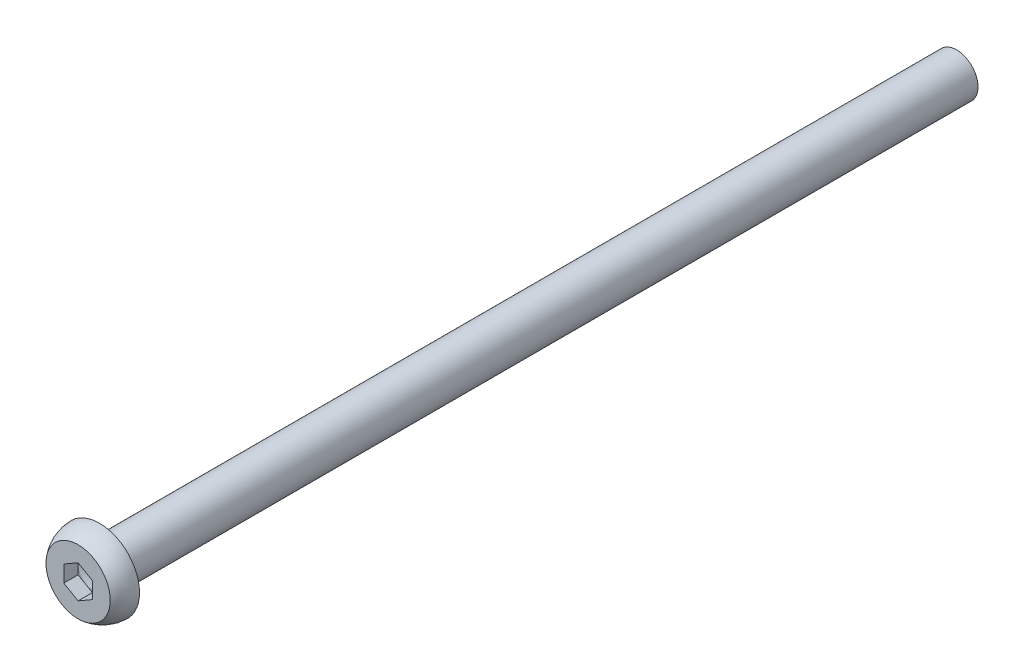
ISO-10303-21;
HEADER;
FILE_DESCRIPTION(('STEP AP214'),'2;1');
FILE_NAME('part.step','',(''),(''),'','','');
FILE_SCHEMA(('AUTOMOTIVE_DESIGN { 1 0 10303 214 1 1 1 1 }'));
ENDSEC;
DATA;
#1=APPLICATION_CONTEXT('core data for automotive mechanical design processes');
#2=APPLICATION_PROTOCOL_DEFINITION('international standard','automotive_design',2000,#1);
#3=PRODUCT_CONTEXT('',#1,'mechanical');
#4=PRODUCT('Part','Part','',(#3));
#5=PRODUCT_RELATED_PRODUCT_CATEGORY('part','',(#4));
#6=PRODUCT_DEFINITION_FORMATION('','',#4);
#7=PRODUCT_DEFINITION_CONTEXT('part definition',#1,'design');
#8=PRODUCT_DEFINITION('design','',#6,#7);
#9=PRODUCT_DEFINITION_SHAPE('','',#8);
#10=(LENGTH_UNIT() NAMED_UNIT(*) SI_UNIT(.MILLI.,.METRE.));
#11=(NAMED_UNIT(*) PLANE_ANGLE_UNIT() SI_UNIT($,.RADIAN.));
#12=(NAMED_UNIT(*) SI_UNIT($,.STERADIAN.) SOLID_ANGLE_UNIT());
#13=UNCERTAINTY_MEASURE_WITH_UNIT(LENGTH_MEASURE(1.E-05),#10,'distance_accuracy_value','');
#14=(GEOMETRIC_REPRESENTATION_CONTEXT(3) GLOBAL_UNCERTAINTY_ASSIGNED_CONTEXT((#13)) GLOBAL_UNIT_ASSIGNED_CONTEXT((#10,
#11,#12)) REPRESENTATION_CONTEXT('',''));
#15=CARTESIAN_POINT('',(0.,0.,0.));
#16=DIRECTION('',(0.,0.,1.));
#17=DIRECTION('',(1.,0.,0.));
#18=AXIS2_PLACEMENT_3D('',#15,#16,#17);
#19=CARTESIAN_POINT('',(0.,2.8,-1.5));
#20=DIRECTION('',(0.,0.,1.));
#21=DIRECTION('',(1.,0.,0.));
#22=AXIS2_PLACEMENT_3D('',#19,#20,#21);
#23=PLANE('',#22);
#24=CARTESIAN_POINT('',(0.,0.,-1.5));
#25=DIRECTION('',(0.,0.,-1.));
#26=DIRECTION('',(-1.,0.,0.));
#27=AXIS2_PLACEMENT_3D('',#24,#25,#26);
#28=CIRCLE('',#27,1.5);
#29=CARTESIAN_POINT('',(-1.5,0.,-1.5));
#30=VERTEX_POINT('',#29);
#31=EDGE_CURVE('E11',#30,#30,#28,.T.);
#32=ORIENTED_EDGE('',*,*,#31,.F.);
#33=EDGE_LOOP('',(#32));
#34=FACE_BOUND('',#33,.T.);
#35=CARTESIAN_POINT('',(0.,0.,-1.5));
#36=DIRECTION('',(0.,0.,1.));
#37=DIRECTION('',(1.,0.,0.));
#38=AXIS2_PLACEMENT_3D('',#35,#36,#37);
#39=CIRCLE('',#38,2.8);
#40=CARTESIAN_POINT('',(2.8,0.,-1.5));
#41=VERTEX_POINT('',#40);
#42=EDGE_CURVE('E48',#41,#41,#39,.T.);
#43=ORIENTED_EDGE('',*,*,#42,.F.);
#44=EDGE_LOOP('',(#43));
#45=FACE_BOUND('',#44,.T.);
#46=ADVANCED_FACE('F45',(#34,#45),#23,.F.);
#47=CARTESIAN_POINT('',(0.,0.,-1.5));
#48=DIRECTION('',(0.,0.,1.));
#49=DIRECTION('',(1.,0.,0.));
#50=AXIS2_PLACEMENT_3D('',#47,#48,#49);
#51=DEGENERATE_TOROIDAL_SURFACE('',#50,0.478438531605624,2.32156146839438,.T.);
#52=CARTESIAN_POINT('',(0.,0.,0.));
#53=DIRECTION('',(0.,0.,1.));
#54=DIRECTION('',(1.,0.,0.));
#55=AXIS2_PLACEMENT_3D('',#52,#53,#54);
#56=CIRCLE('',#55,2.25034362261176);
#57=CARTESIAN_POINT('',(2.25034362261176,0.,0.));
#58=VERTEX_POINT('',#57);
#59=EDGE_CURVE('E206',#58,#58,#56,.T.);
#60=ORIENTED_EDGE('',*,*,#59,.F.);
#61=EDGE_LOOP('',(#60));
#62=FACE_BOUND('',#61,.T.);
#63=ORIENTED_EDGE('',*,*,#42,.T.);
#64=EDGE_LOOP('',(#63));
#65=FACE_BOUND('',#64,.T.);
#66=ADVANCED_FACE('F215',(#62,#65),#51,.T.);
#67=CARTESIAN_POINT('',(0.,1.,0.));
#68=DIRECTION('',(0.,0.,-1.));
#69=DIRECTION('',(-1.,0.,0.));
#70=AXIS2_PLACEMENT_3D('',#67,#68,#69);
#71=PLANE('',#70);
#72=DIRECTION('',(-0.866025403784439,-0.5,0.));
#73=VECTOR('',#72,1.);
#74=CARTESIAN_POINT('',(0.,1.15470053837925,0.));
#75=LINE('',#74,#73);
#76=CARTESIAN_POINT('',(0.,1.15470053837925,0.));
#77=VERTEX_POINT('',#76);
#78=CARTESIAN_POINT('',(-1.,0.577350269189626,0.));
#79=VERTEX_POINT('',#78);
#80=EDGE_CURVE('E170',#77,#79,#75,.T.);
#81=ORIENTED_EDGE('',*,*,#80,.F.);
#82=DIRECTION('',(-0.866025403784439,0.499999999999999,0.));
#83=VECTOR('',#82,1.);
#84=CARTESIAN_POINT('',(1.,0.577350269189627,0.));
#85=LINE('',#84,#83);
#86=CARTESIAN_POINT('',(1.,0.577350269189627,0.));
#87=VERTEX_POINT('',#86);
#88=EDGE_CURVE('E61',#87,#77,#85,.T.);
#89=ORIENTED_EDGE('',*,*,#88,.F.);
#90=DIRECTION('',(0.,1.,0.));
#91=VECTOR('',#90,1.);
#92=CARTESIAN_POINT('',(1.,-0.577350269189626,0.));
#93=LINE('',#92,#91);
#94=CARTESIAN_POINT('',(1.,-0.577350269189626,0.));
#95=VERTEX_POINT('',#94);
#96=EDGE_CURVE('E129',#95,#87,#93,.T.);
#97=ORIENTED_EDGE('',*,*,#96,.F.);
#98=DIRECTION('',(0.866025403784438,0.5,0.));
#99=VECTOR('',#98,1.);
#100=CARTESIAN_POINT('',(0.,-1.15470053837925,0.));
#101=LINE('',#100,#99);
#102=CARTESIAN_POINT('',(0.,-1.15470053837925,0.));
#103=VERTEX_POINT('',#102);
#104=EDGE_CURVE('E182',#103,#95,#101,.T.);
#105=ORIENTED_EDGE('',*,*,#104,.F.);
#106=DIRECTION('',(0.866025403784439,-0.5,0.));
#107=VECTOR('',#106,1.);
#108=CARTESIAN_POINT('',(-1.,-0.577350269189626,0.));
#109=LINE('',#108,#107);
#110=CARTESIAN_POINT('',(-1.,-0.577350269189626,0.));
#111=VERTEX_POINT('',#110);
#112=EDGE_CURVE('E178',#111,#103,#109,.T.);
#113=ORIENTED_EDGE('',*,*,#112,.F.);
#114=DIRECTION('',(0.,-1.,0.));
#115=VECTOR('',#114,1.);
#116=CARTESIAN_POINT('',(-1.,0.577350269189626,0.));
#117=LINE('',#116,#115);
#118=EDGE_CURVE('E174',#79,#111,#117,.T.);
#119=ORIENTED_EDGE('',*,*,#118,.F.);
#120=EDGE_LOOP('',(#81,#89,#97,#105,#113,#119));
#121=FACE_BOUND('',#120,.T.);
#122=ORIENTED_EDGE('',*,*,#59,.T.);
#123=EDGE_LOOP('',(#122));
#124=FACE_BOUND('',#123,.T.);
#125=ADVANCED_FACE('F224',(#121,#124),#71,.F.);
#126=CARTESIAN_POINT('',(0.,0.,-1.));
#127=DIRECTION('',(0.,0.,1.));
#128=DIRECTION('',(1.,0.,0.));
#129=AXIS2_PLACEMENT_3D('',#126,#127,#128);
#130=PLANE('',#129);
#131=CARTESIAN_POINT('',(0.,0.,-1.));
#132=DIRECTION('',(0.,0.,1.));
#133=DIRECTION('',(1.,0.,0.));
#134=AXIS2_PLACEMENT_3D('',#131,#132,#133);
#135=CIRCLE('',#134,1.);
#136=CARTESIAN_POINT('',(0.5,-0.866025403784439,-1.));
#137=VERTEX_POINT('',#136);
#138=CARTESIAN_POINT('',(1.,0.,-1.));
#139=VERTEX_POINT('',#138);
#140=EDGE_CURVE('E192',#137,#139,#135,.T.);
#141=ORIENTED_EDGE('',*,*,#140,.F.);
#142=DIRECTION('',(0.866025403784438,0.5,0.));
#143=VECTOR('',#142,1.);
#144=CARTESIAN_POINT('',(0.,-1.15470053837925,-1.));
#145=LINE('',#144,#143);
#146=CARTESIAN_POINT('',(1.,-0.577350269189626,-1.));
#147=VERTEX_POINT('',#146);
#148=EDGE_CURVE('E159',#137,#147,#145,.T.);
#149=ORIENTED_EDGE('',*,*,#148,.T.);
#150=DIRECTION('',(0.,1.,0.));
#151=VECTOR('',#150,1.);
#152=CARTESIAN_POINT('',(1.,-0.577350269189626,-1.));
#153=LINE('',#152,#151);
#154=EDGE_CURVE('E138',#147,#139,#153,.T.);
#155=ORIENTED_EDGE('',*,*,#154,.T.);
#156=EDGE_LOOP('',(#141,#149,#155));
#157=FACE_BOUND('',#156,.T.);
#158=ADVANCED_FACE('F242',(#157),#130,.T.);
#159=CARTESIAN_POINT('',(-0.5,-0.866025403784439,-1.));
#160=VERTEX_POINT('',#159);
#161=EDGE_CURVE('E289',#160,#137,#135,.T.);
#162=ORIENTED_EDGE('',*,*,#161,.F.);
#163=DIRECTION('',(0.866025403784439,-0.5,0.));
#164=VECTOR('',#163,1.);
#165=CARTESIAN_POINT('',(-1.,-0.577350269189626,-1.));
#166=LINE('',#165,#164);
#167=CARTESIAN_POINT('',(0.,-1.15470053837925,-1.));
#168=VERTEX_POINT('',#167);
#169=EDGE_CURVE('E154',#160,#168,#166,.T.);
#170=ORIENTED_EDGE('',*,*,#169,.T.);
#171=EDGE_CURVE('E160',#168,#137,#145,.T.);
#172=ORIENTED_EDGE('',*,*,#171,.T.);
#173=EDGE_LOOP('',(#162,#170,#172));
#174=FACE_BOUND('',#173,.T.);
#175=ADVANCED_FACE('F245',(#174),#130,.T.);
#176=CARTESIAN_POINT('',(-1.,0.,-1.));
#177=VERTEX_POINT('',#176);
#178=EDGE_CURVE('E285',#177,#160,#135,.T.);
#179=ORIENTED_EDGE('',*,*,#178,.F.);
#180=DIRECTION('',(0.,-1.,0.));
#181=VECTOR('',#180,1.);
#182=CARTESIAN_POINT('',(-1.,0.577350269189626,-1.));
#183=LINE('',#182,#181);
#184=CARTESIAN_POINT('',(-1.,-0.577350269189626,-1.));
#185=VERTEX_POINT('',#184);
#186=EDGE_CURVE('E145',#177,#185,#183,.T.);
#187=ORIENTED_EDGE('',*,*,#186,.T.);
#188=EDGE_CURVE('E155',#185,#160,#166,.T.);
#189=ORIENTED_EDGE('',*,*,#188,.T.);
#190=EDGE_LOOP('',(#179,#187,#189));
#191=FACE_BOUND('',#190,.T.);
#192=ADVANCED_FACE('F314',(#191),#130,.T.);
#193=CARTESIAN_POINT('',(-0.5,0.866025403784439,-1.));
#194=VERTEX_POINT('',#193);
#195=EDGE_CURVE('E281',#194,#177,#135,.T.);
#196=ORIENTED_EDGE('',*,*,#195,.F.);
#197=DIRECTION('',(-0.866025403784439,-0.5,0.));
#198=VECTOR('',#197,1.);
#199=CARTESIAN_POINT('',(0.,1.15470053837925,-1.));
#200=LINE('',#199,#198);
#201=CARTESIAN_POINT('',(-1.,0.577350269189626,-1.));
#202=VERTEX_POINT('',#201);
#203=EDGE_CURVE('E143',#194,#202,#200,.T.);
#204=ORIENTED_EDGE('',*,*,#203,.T.);
#205=EDGE_CURVE('E149',#202,#177,#183,.T.);
#206=ORIENTED_EDGE('',*,*,#205,.T.);
#207=EDGE_LOOP('',(#196,#204,#206));
#208=FACE_BOUND('',#207,.T.);
#209=ADVANCED_FACE('F280',(#208),#130,.T.);
#210=CARTESIAN_POINT('',(0.5,0.866025403784439,-1.));
#211=VERTEX_POINT('',#210);
#212=EDGE_CURVE('E126',#211,#194,#135,.T.);
#213=ORIENTED_EDGE('',*,*,#212,.F.);
#214=DIRECTION('',(-0.866025403784439,0.499999999999999,0.));
#215=VECTOR('',#214,1.);
#216=CARTESIAN_POINT('',(1.,0.577350269189627,-1.));
#217=LINE('',#216,#215);
#218=CARTESIAN_POINT('',(0.,1.15470053837925,-1.));
#219=VERTEX_POINT('',#218);
#220=EDGE_CURVE('E121',#211,#219,#217,.T.);
#221=ORIENTED_EDGE('',*,*,#220,.T.);
#222=EDGE_CURVE('E124',#219,#194,#200,.T.);
#223=ORIENTED_EDGE('',*,*,#222,.T.);
#224=EDGE_LOOP('',(#213,#221,#223));
#225=FACE_BOUND('',#224,.T.);
#226=ADVANCED_FACE('F122',(#225),#130,.T.);
#227=EDGE_CURVE('E204',#139,#211,#135,.T.);
#228=ORIENTED_EDGE('',*,*,#227,.F.);
#229=CARTESIAN_POINT('',(1.,0.577350269189627,-1.));
#230=VERTEX_POINT('',#229);
#231=EDGE_CURVE('E164',#139,#230,#153,.T.);
#232=ORIENTED_EDGE('',*,*,#231,.T.);
#233=EDGE_CURVE('E69',#230,#211,#217,.T.);
#234=ORIENTED_EDGE('',*,*,#233,.T.);
#235=EDGE_LOOP('',(#228,#232,#234));
#236=FACE_BOUND('',#235,.T.);
#237=ADVANCED_FACE('F247',(#236),#130,.T.);
#238=CARTESIAN_POINT('',(1.,0.577350269189627,-1.));
#239=DIRECTION('',(0.499999999999999,0.866025403784439,0.));
#240=DIRECTION('',(-0.866025403784439,0.5,0.));
#241=AXIS2_PLACEMENT_3D('',#238,#239,#240);
#242=PLANE('',#241);
#243=ORIENTED_EDGE('',*,*,#88,.T.);
#244=DIRECTION('',(0.,0.,1.));
#245=VECTOR('',#244,1.);
#246=CARTESIAN_POINT('',(0.,1.15470053837925,-1.));
#247=LINE('',#246,#245);
#248=EDGE_CURVE('E131',#219,#77,#247,.T.);
#249=ORIENTED_EDGE('',*,*,#248,.F.);
#250=ORIENTED_EDGE('',*,*,#220,.F.);
#251=ORIENTED_EDGE('',*,*,#233,.F.);
#252=DIRECTION('',(0.,0.,1.));
#253=VECTOR('',#252,1.);
#254=CARTESIAN_POINT('',(1.,0.577350269189627,-1.));
#255=LINE('',#254,#253);
#256=EDGE_CURVE('E189',#230,#87,#255,.T.);
#257=ORIENTED_EDGE('',*,*,#256,.T.);
#258=EDGE_LOOP('',(#243,#249,#250,#251,#257));
#259=FACE_BOUND('',#258,.T.);
#260=ADVANCED_FACE('F132',(#259),#242,.F.);
#261=CARTESIAN_POINT('',(1.,-0.577350269189626,-1.));
#262=DIRECTION('',(1.,0.,0.));
#263=DIRECTION('',(0.,1.,0.));
#264=AXIS2_PLACEMENT_3D('',#261,#262,#263);
#265=PLANE('',#264);
#266=ORIENTED_EDGE('',*,*,#96,.T.);
#267=ORIENTED_EDGE('',*,*,#256,.F.);
#268=ORIENTED_EDGE('',*,*,#231,.F.);
#269=ORIENTED_EDGE('',*,*,#154,.F.);
#270=DIRECTION('',(0.,0.,1.));
#271=VECTOR('',#270,1.);
#272=CARTESIAN_POINT('',(1.,-0.577350269189626,-1.));
#273=LINE('',#272,#271);
#274=EDGE_CURVE('E193',#147,#95,#273,.T.);
#275=ORIENTED_EDGE('',*,*,#274,.T.);
#276=EDGE_LOOP('',(#266,#267,#268,#269,#275));
#277=FACE_BOUND('',#276,.T.);
#278=ADVANCED_FACE('F248',(#277),#265,.F.);
#279=CARTESIAN_POINT('',(0.,-1.15470053837925,-1.));
#280=DIRECTION('',(0.5,-0.866025403784439,0.));
#281=DIRECTION('',(0.866025403784438,0.5,0.));
#282=AXIS2_PLACEMENT_3D('',#279,#280,#281);
#283=PLANE('',#282);
#284=ORIENTED_EDGE('',*,*,#104,.T.);
#285=ORIENTED_EDGE('',*,*,#274,.F.);
#286=ORIENTED_EDGE('',*,*,#148,.F.);
#287=ORIENTED_EDGE('',*,*,#171,.F.);
#288=DIRECTION('',(0.,0.,1.));
#289=VECTOR('',#288,1.);
#290=CARTESIAN_POINT('',(0.,-1.15470053837925,-1.));
#291=LINE('',#290,#289);
#292=EDGE_CURVE('E196',#168,#103,#291,.T.);
#293=ORIENTED_EDGE('',*,*,#292,.T.);
#294=EDGE_LOOP('',(#284,#285,#286,#287,#293));
#295=FACE_BOUND('',#294,.T.);
#296=ADVANCED_FACE('F251',(#295),#283,.F.);
#297=CARTESIAN_POINT('',(-1.,-0.577350269189626,-1.));
#298=DIRECTION('',(-0.5,-0.866025403784439,0.));
#299=DIRECTION('',(0.866025403784439,-0.5,0.));
#300=AXIS2_PLACEMENT_3D('',#297,#298,#299);
#301=PLANE('',#300);
#302=ORIENTED_EDGE('',*,*,#112,.T.);
#303=ORIENTED_EDGE('',*,*,#292,.F.);
#304=ORIENTED_EDGE('',*,*,#169,.F.);
#305=ORIENTED_EDGE('',*,*,#188,.F.);
#306=DIRECTION('',(0.,0.,1.));
#307=VECTOR('',#306,1.);
#308=CARTESIAN_POINT('',(-1.,-0.577350269189626,-1.));
#309=LINE('',#308,#307);
#310=EDGE_CURVE('E199',#185,#111,#309,.T.);
#311=ORIENTED_EDGE('',*,*,#310,.T.);
#312=EDGE_LOOP('',(#302,#303,#304,#305,#311));
#313=FACE_BOUND('',#312,.T.);
#314=ADVANCED_FACE('F255',(#313),#301,.F.);
#315=CARTESIAN_POINT('',(-1.,0.577350269189626,-1.));
#316=DIRECTION('',(-1.,0.,0.));
#317=DIRECTION('',(0.,-1.,0.));
#318=AXIS2_PLACEMENT_3D('',#315,#316,#317);
#319=PLANE('',#318);
#320=ORIENTED_EDGE('',*,*,#118,.T.);
#321=ORIENTED_EDGE('',*,*,#310,.F.);
#322=ORIENTED_EDGE('',*,*,#186,.F.);
#323=ORIENTED_EDGE('',*,*,#205,.F.);
#324=DIRECTION('',(0.,0.,1.));
#325=VECTOR('',#324,1.);
#326=CARTESIAN_POINT('',(-1.,0.577350269189626,-1.));
#327=LINE('',#326,#325);
#328=EDGE_CURVE('E137',#202,#79,#327,.T.);
#329=ORIENTED_EDGE('',*,*,#328,.T.);
#330=EDGE_LOOP('',(#320,#321,#322,#323,#329));
#331=FACE_BOUND('',#330,.T.);
#332=ADVANCED_FACE('F259',(#331),#319,.F.);
#333=CARTESIAN_POINT('',(0.,1.15470053837925,-1.));
#334=DIRECTION('',(-0.5,0.866025403784439,0.));
#335=DIRECTION('',(-0.866025403784439,-0.5,0.));
#336=AXIS2_PLACEMENT_3D('',#333,#334,#335);
#337=PLANE('',#336);
#338=ORIENTED_EDGE('',*,*,#80,.T.);
#339=ORIENTED_EDGE('',*,*,#328,.F.);
#340=ORIENTED_EDGE('',*,*,#203,.F.);
#341=ORIENTED_EDGE('',*,*,#222,.F.);
#342=ORIENTED_EDGE('',*,*,#248,.T.);
#343=EDGE_LOOP('',(#338,#339,#340,#341,#342));
#344=FACE_BOUND('',#343,.T.);
#345=ADVANCED_FACE('F141',(#344),#337,.F.);
#346=CARTESIAN_POINT('',(0.,0.,-1.));
#347=DIRECTION('',(0.,0.,1.));
#348=DIRECTION('',(1.,0.,0.));
#349=AXIS2_PLACEMENT_3D('',#346,#347,#348);
#350=CONICAL_SURFACE('',#349,1.,1.32753361128639);
#351=CARTESIAN_POINT('',(0.,0.,-1.2481775856587));
#352=VERTEX_POINT('',#351);
#353=VERTEX_LOOP('',#352);
#354=FACE_BOUND('',#353,.T.);
#355=ORIENTED_EDGE('',*,*,#227,.T.);
#356=ORIENTED_EDGE('',*,*,#212,.T.);
#357=ORIENTED_EDGE('',*,*,#195,.T.);
#358=ORIENTED_EDGE('',*,*,#178,.T.);
#359=ORIENTED_EDGE('',*,*,#161,.T.);
#360=ORIENTED_EDGE('',*,*,#140,.T.);
#361=EDGE_LOOP('',(#355,#356,#357,#358,#359,#360));
#362=FACE_BOUND('',#361,.T.);
#363=ADVANCED_FACE('F230',(#354,#362),#350,.F.);
#364=CARTESIAN_POINT('',(0.,0.,-61.5));
#365=DIRECTION('',(0.,0.,1.));
#366=DIRECTION('',(1.,0.,0.));
#367=AXIS2_PLACEMENT_3D('',#364,#365,#366);
#368=CYLINDRICAL_SURFACE('',#367,1.5);
#369=CARTESIAN_POINT('',(0.,0.,-61.5));
#370=DIRECTION('',(0.,0.,-1.));
#371=DIRECTION('',(-1.,0.,0.));
#372=AXIS2_PLACEMENT_3D('',#369,#370,#371);
#373=CIRCLE('',#372,1.5);
#374=CARTESIAN_POINT('',(-1.5,0.,-61.5));
#375=VERTEX_POINT('',#374);
#376=EDGE_CURVE('E171',#375,#375,#373,.T.);
#377=ORIENTED_EDGE('',*,*,#376,.F.);
#378=EDGE_LOOP('',(#377));
#379=FACE_BOUND('',#378,.T.);
#380=ORIENTED_EDGE('',*,*,#31,.T.);
#381=EDGE_LOOP('',(#380));
#382=FACE_BOUND('',#381,.T.);
#383=ADVANCED_FACE('F228',(#379,#382),#368,.T.);
#384=CARTESIAN_POINT('',(0.,0.,-61.5));
#385=DIRECTION('',(0.,0.,-1.));
#386=DIRECTION('',(-1.,0.,0.));
#387=AXIS2_PLACEMENT_3D('',#384,#385,#386);
#388=PLANE('',#387);
#389=ORIENTED_EDGE('',*,*,#376,.T.);
#390=EDGE_LOOP('',(#389));
#391=FACE_BOUND('',#390,.T.);
#392=ADVANCED_FACE('F229',(#391),#388,.T.);
#393=CLOSED_SHELL('',(#46,#66,#125,#158,#175,#192,#209,#226,#237,#260,#278,#296,#314,#332,#345,
#363,#383,#392));
#394=MANIFOLD_SOLID_BREP('B2',#393);
#395=ADVANCED_BREP_SHAPE_REPRESENTATION('',(#18,#394),#14);
#396=SHAPE_DEFINITION_REPRESENTATION(#9,#395);
ENDSEC;
END-ISO-10303-21;
